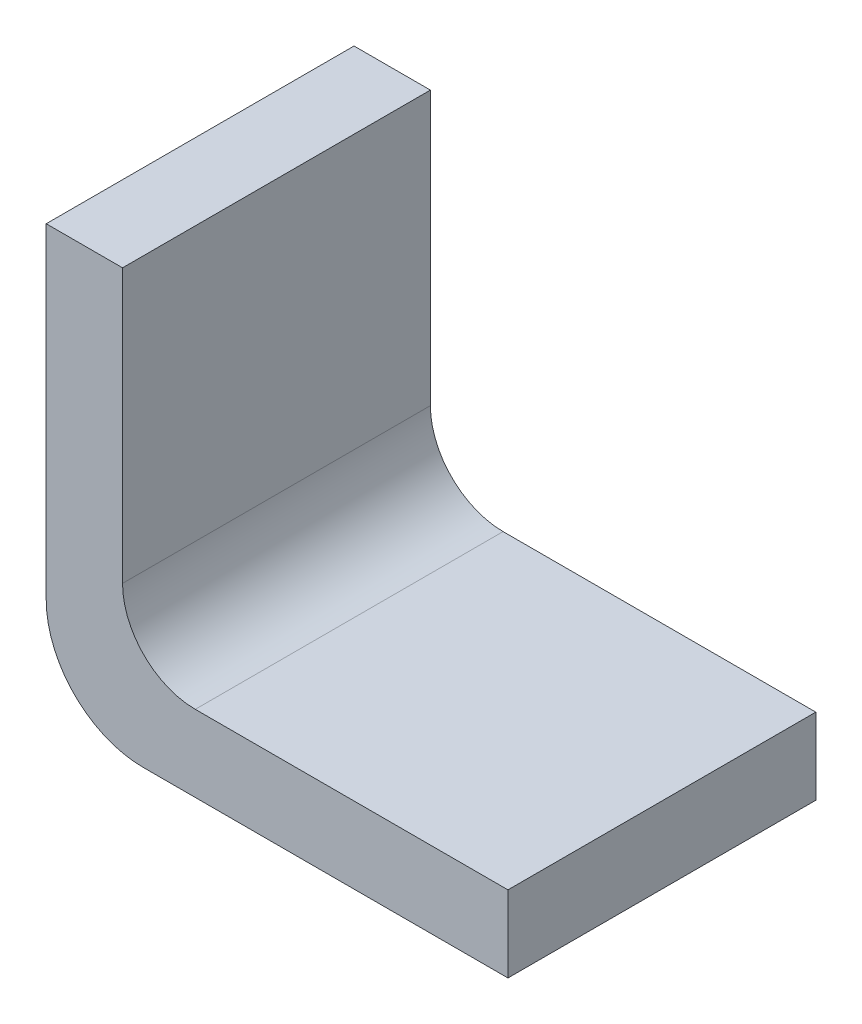
ISO-10303-21;
HEADER;
FILE_DESCRIPTION(('STEP AP214'),'2;1');
FILE_NAME('part.step','',(''),(''),'','','');
FILE_SCHEMA(('AUTOMOTIVE_DESIGN { 1 0 10303 214 1 1 1 1 }'));
ENDSEC;
DATA;
#1=APPLICATION_CONTEXT('core data for automotive mechanical design processes');
#2=APPLICATION_PROTOCOL_DEFINITION('international standard','automotive_design',2000,#1);
#3=PRODUCT_CONTEXT('',#1,'mechanical');
#4=PRODUCT('Part','Part','',(#3));
#5=PRODUCT_RELATED_PRODUCT_CATEGORY('part','',(#4));
#6=PRODUCT_DEFINITION_FORMATION('','',#4);
#7=PRODUCT_DEFINITION_CONTEXT('part definition',#1,'design');
#8=PRODUCT_DEFINITION('design','',#6,#7);
#9=PRODUCT_DEFINITION_SHAPE('','',#8);
#10=(LENGTH_UNIT() NAMED_UNIT(*) SI_UNIT(.MILLI.,.METRE.));
#11=(NAMED_UNIT(*) PLANE_ANGLE_UNIT() SI_UNIT($,.RADIAN.));
#12=(NAMED_UNIT(*) SI_UNIT($,.STERADIAN.) SOLID_ANGLE_UNIT());
#13=UNCERTAINTY_MEASURE_WITH_UNIT(LENGTH_MEASURE(1.E-05),#10,'distance_accuracy_value','');
#14=(GEOMETRIC_REPRESENTATION_CONTEXT(3) GLOBAL_UNCERTAINTY_ASSIGNED_CONTEXT((#13)) GLOBAL_UNIT_ASSIGNED_CONTEXT((#10,
#11,#12)) REPRESENTATION_CONTEXT('',''));
#15=CARTESIAN_POINT('',(0.,0.,0.));
#16=DIRECTION('',(0.,0.,1.));
#17=DIRECTION('',(1.,0.,0.));
#18=AXIS2_PLACEMENT_3D('',#15,#16,#17);
#19=CARTESIAN_POINT('',(2.,2.,6.35));
#20=DIRECTION('',(0.,0.,-1.));
#21=DIRECTION('',(-1.,0.,0.));
#22=AXIS2_PLACEMENT_3D('',#19,#20,#21);
#23=CYLINDRICAL_SURFACE('',#22,2.);
#24=CARTESIAN_POINT('',(2.,2.,0.));
#25=DIRECTION('',(0.,0.,1.));
#26=DIRECTION('',(1.,0.,0.));
#27=AXIS2_PLACEMENT_3D('',#24,#25,#26);
#28=CIRCLE('',#27,2.);
#29=CARTESIAN_POINT('',(0.,2.00000000000001,0.));
#30=VERTEX_POINT('',#29);
#31=CARTESIAN_POINT('',(2.00000000000001,0.,0.));
#32=VERTEX_POINT('',#31);
#33=EDGE_CURVE('E129',#30,#32,#28,.T.);
#34=ORIENTED_EDGE('',*,*,#33,.T.);
#35=DIRECTION('',(0.,0.,-1.));
#36=VECTOR('',#35,1.);
#37=CARTESIAN_POINT('',(2.00000000000001,0.,6.35));
#38=LINE('',#37,#36);
#39=CARTESIAN_POINT('',(2.00000000000001,0.,6.35));
#40=VERTEX_POINT('',#39);
#41=EDGE_CURVE('E11',#40,#32,#38,.T.);
#42=ORIENTED_EDGE('',*,*,#41,.F.);
#43=CARTESIAN_POINT('',(2.,2.,6.35));
#44=DIRECTION('',(0.,0.,1.));
#45=DIRECTION('',(1.,0.,0.));
#46=AXIS2_PLACEMENT_3D('',#43,#44,#45);
#47=CIRCLE('',#46,2.);
#48=CARTESIAN_POINT('',(0.,2.00000000000001,6.35));
#49=VERTEX_POINT('',#48);
#50=EDGE_CURVE('E143',#49,#40,#47,.T.);
#51=ORIENTED_EDGE('',*,*,#50,.F.);
#52=DIRECTION('',(0.,0.,-1.));
#53=VECTOR('',#52,1.);
#54=CARTESIAN_POINT('',(0.,2.00000000000001,6.35));
#55=LINE('',#54,#53);
#56=EDGE_CURVE('E125',#49,#30,#55,.T.);
#57=ORIENTED_EDGE('',*,*,#56,.T.);
#58=EDGE_LOOP('',(#34,#42,#51,#57));
#59=FACE_BOUND('',#58,.T.);
#60=ADVANCED_FACE('F33',(#59),#23,.T.);
#61=CARTESIAN_POINT('',(9.525,0.,6.35));
#62=DIRECTION('',(0.,1.,0.));
#63=DIRECTION('',(-1.,0.,0.));
#64=AXIS2_PLACEMENT_3D('',#61,#62,#63);
#65=PLANE('',#64);
#66=DIRECTION('',(1.,0.,0.));
#67=VECTOR('',#66,1.);
#68=CARTESIAN_POINT('',(9.525,0.,0.));
#69=LINE('',#68,#67);
#70=CARTESIAN_POINT('',(9.525,0.,0.));
#71=VERTEX_POINT('',#70);
#72=EDGE_CURVE('E132',#32,#71,#69,.T.);
#73=ORIENTED_EDGE('',*,*,#72,.T.);
#74=DIRECTION('',(0.,0.,-1.));
#75=VECTOR('',#74,1.);
#76=CARTESIAN_POINT('',(9.525,0.,6.35));
#77=LINE('',#76,#75);
#78=CARTESIAN_POINT('',(9.525,0.,6.35));
#79=VERTEX_POINT('',#78);
#80=EDGE_CURVE('E41',#79,#71,#77,.T.);
#81=ORIENTED_EDGE('',*,*,#80,.F.);
#82=DIRECTION('',(1.,0.,0.));
#83=VECTOR('',#82,1.);
#84=CARTESIAN_POINT('',(9.525,0.,6.35));
#85=LINE('',#84,#83);
#86=EDGE_CURVE('E92',#40,#79,#85,.T.);
#87=ORIENTED_EDGE('',*,*,#86,.F.);
#88=ORIENTED_EDGE('',*,*,#41,.T.);
#89=EDGE_LOOP('',(#73,#81,#87,#88));
#90=FACE_BOUND('',#89,.T.);
#91=ADVANCED_FACE('F178',(#90),#65,.F.);
#92=CARTESIAN_POINT('',(9.525,1.5748,6.35));
#93=DIRECTION('',(-1.,0.,0.));
#94=DIRECTION('',(0.,0.,1.));
#95=AXIS2_PLACEMENT_3D('',#92,#93,#94);
#96=PLANE('',#95);
#97=DIRECTION('',(0.,1.,0.));
#98=VECTOR('',#97,1.);
#99=CARTESIAN_POINT('',(9.525,1.5748,0.));
#100=LINE('',#99,#98);
#101=CARTESIAN_POINT('',(9.525,1.5748,0.));
#102=VERTEX_POINT('',#101);
#103=EDGE_CURVE('E134',#71,#102,#100,.T.);
#104=ORIENTED_EDGE('',*,*,#103,.T.);
#105=DIRECTION('',(0.,0.,-1.));
#106=VECTOR('',#105,1.);
#107=CARTESIAN_POINT('',(9.525,1.5748,6.35));
#108=LINE('',#107,#106);
#109=CARTESIAN_POINT('',(9.525,1.5748,6.35));
#110=VERTEX_POINT('',#109);
#111=EDGE_CURVE('E150',#110,#102,#108,.T.);
#112=ORIENTED_EDGE('',*,*,#111,.F.);
#113=DIRECTION('',(0.,1.,0.));
#114=VECTOR('',#113,1.);
#115=CARTESIAN_POINT('',(9.525,1.5748,6.35));
#116=LINE('',#115,#114);
#117=EDGE_CURVE('E158',#79,#110,#116,.T.);
#118=ORIENTED_EDGE('',*,*,#117,.F.);
#119=ORIENTED_EDGE('',*,*,#80,.T.);
#120=EDGE_LOOP('',(#104,#112,#118,#119));
#121=FACE_BOUND('',#120,.T.);
#122=ADVANCED_FACE('F156',(#121),#96,.F.);
#123=CARTESIAN_POINT('',(3.0748,1.5748,6.35));
#124=DIRECTION('',(0.,-1.,0.));
#125=DIRECTION('',(1.,0.,0.));
#126=AXIS2_PLACEMENT_3D('',#123,#124,#125);
#127=PLANE('',#126);
#128=DIRECTION('',(-1.,0.,0.));
#129=VECTOR('',#128,1.);
#130=CARTESIAN_POINT('',(3.0748,1.5748,0.));
#131=LINE('',#130,#129);
#132=CARTESIAN_POINT('',(3.0748,1.5748,0.));
#133=VERTEX_POINT('',#132);
#134=EDGE_CURVE('E136',#102,#133,#131,.T.);
#135=ORIENTED_EDGE('',*,*,#134,.T.);
#136=DIRECTION('',(0.,0.,-1.));
#137=VECTOR('',#136,1.);
#138=CARTESIAN_POINT('',(3.0748,1.5748,6.35));
#139=LINE('',#138,#137);
#140=CARTESIAN_POINT('',(3.0748,1.5748,6.35));
#141=VERTEX_POINT('',#140);
#142=EDGE_CURVE('E147',#141,#133,#139,.T.);
#143=ORIENTED_EDGE('',*,*,#142,.F.);
#144=DIRECTION('',(-1.,0.,0.));
#145=VECTOR('',#144,1.);
#146=CARTESIAN_POINT('',(3.0748,1.5748,6.35));
#147=LINE('',#146,#145);
#148=EDGE_CURVE('E170',#110,#141,#147,.T.);
#149=ORIENTED_EDGE('',*,*,#148,.F.);
#150=ORIENTED_EDGE('',*,*,#111,.T.);
#151=EDGE_LOOP('',(#135,#143,#149,#150));
#152=FACE_BOUND('',#151,.T.);
#153=ADVANCED_FACE('F166',(#152),#127,.F.);
#154=CARTESIAN_POINT('',(3.0748,3.0748,6.35));
#155=DIRECTION('',(0.,0.,-1.));
#156=DIRECTION('',(-1.,0.,0.));
#157=AXIS2_PLACEMENT_3D('',#154,#155,#156);
#158=CYLINDRICAL_SURFACE('',#157,1.5);
#159=CARTESIAN_POINT('',(3.0748,3.0748,0.));
#160=DIRECTION('',(0.,0.,-1.));
#161=DIRECTION('',(-1.,0.,0.));
#162=AXIS2_PLACEMENT_3D('',#159,#160,#161);
#163=CIRCLE('',#162,1.5);
#164=CARTESIAN_POINT('',(1.5748,3.0748,0.));
#165=VERTEX_POINT('',#164);
#166=EDGE_CURVE('E138',#133,#165,#163,.T.);
#167=ORIENTED_EDGE('',*,*,#166,.T.);
#168=DIRECTION('',(0.,0.,-1.));
#169=VECTOR('',#168,1.);
#170=CARTESIAN_POINT('',(1.5748,3.0748,6.35));
#171=LINE('',#170,#169);
#172=CARTESIAN_POINT('',(1.5748,3.0748,6.35));
#173=VERTEX_POINT('',#172);
#174=EDGE_CURVE('E120',#173,#165,#171,.T.);
#175=ORIENTED_EDGE('',*,*,#174,.F.);
#176=CARTESIAN_POINT('',(3.0748,3.0748,6.35));
#177=DIRECTION('',(0.,0.,-1.));
#178=DIRECTION('',(-1.,0.,0.));
#179=AXIS2_PLACEMENT_3D('',#176,#177,#178);
#180=CIRCLE('',#179,1.5);
#181=EDGE_CURVE('E111',#141,#173,#180,.T.);
#182=ORIENTED_EDGE('',*,*,#181,.F.);
#183=ORIENTED_EDGE('',*,*,#142,.T.);
#184=EDGE_LOOP('',(#167,#175,#182,#183));
#185=FACE_BOUND('',#184,.T.);
#186=ADVANCED_FACE('F169',(#185),#158,.F.);
#187=CARTESIAN_POINT('',(1.5748,8.7122,6.35));
#188=DIRECTION('',(-1.,0.,0.));
#189=DIRECTION('',(0.,-1.,0.));
#190=AXIS2_PLACEMENT_3D('',#187,#188,#189);
#191=PLANE('',#190);
#192=DIRECTION('',(0.,1.,0.));
#193=VECTOR('',#192,1.);
#194=CARTESIAN_POINT('',(1.5748,8.7122,0.));
#195=LINE('',#194,#193);
#196=CARTESIAN_POINT('',(1.5748,8.7122,0.));
#197=VERTEX_POINT('',#196);
#198=EDGE_CURVE('E119',#165,#197,#195,.T.);
#199=ORIENTED_EDGE('',*,*,#198,.T.);
#200=DIRECTION('',(0.,0.,-1.));
#201=VECTOR('',#200,1.);
#202=CARTESIAN_POINT('',(1.5748,8.7122,6.35));
#203=LINE('',#202,#201);
#204=CARTESIAN_POINT('',(1.5748,8.7122,6.35));
#205=VERTEX_POINT('',#204);
#206=EDGE_CURVE('E116',#205,#197,#203,.T.);
#207=ORIENTED_EDGE('',*,*,#206,.F.);
#208=DIRECTION('',(0.,1.,0.));
#209=VECTOR('',#208,1.);
#210=CARTESIAN_POINT('',(1.5748,8.7122,6.35));
#211=LINE('',#210,#209);
#212=EDGE_CURVE('E105',#173,#205,#211,.T.);
#213=ORIENTED_EDGE('',*,*,#212,.F.);
#214=ORIENTED_EDGE('',*,*,#174,.T.);
#215=EDGE_LOOP('',(#199,#207,#213,#214));
#216=FACE_BOUND('',#215,.T.);
#217=ADVANCED_FACE('F117',(#216),#191,.F.);
#218=CARTESIAN_POINT('',(0.,8.7122,6.35));
#219=DIRECTION('',(0.,-1.,0.));
#220=DIRECTION('',(0.,0.,-1.));
#221=AXIS2_PLACEMENT_3D('',#218,#219,#220);
#222=PLANE('',#221);
#223=DIRECTION('',(-1.,0.,0.));
#224=VECTOR('',#223,1.);
#225=CARTESIAN_POINT('',(0.,8.7122,0.));
#226=LINE('',#225,#224);
#227=CARTESIAN_POINT('',(0.,8.7122,0.));
#228=VERTEX_POINT('',#227);
#229=EDGE_CURVE('E78',#197,#228,#226,.T.);
#230=ORIENTED_EDGE('',*,*,#229,.T.);
#231=DIRECTION('',(0.,0.,-1.));
#232=VECTOR('',#231,1.);
#233=CARTESIAN_POINT('',(0.,8.7122,6.35));
#234=LINE('',#233,#232);
#235=CARTESIAN_POINT('',(0.,8.7122,6.35));
#236=VERTEX_POINT('',#235);
#237=EDGE_CURVE('E121',#236,#228,#234,.T.);
#238=ORIENTED_EDGE('',*,*,#237,.F.);
#239=DIRECTION('',(-1.,0.,0.));
#240=VECTOR('',#239,1.);
#241=CARTESIAN_POINT('',(0.,8.7122,6.35));
#242=LINE('',#241,#240);
#243=EDGE_CURVE('E109',#205,#236,#242,.T.);
#244=ORIENTED_EDGE('',*,*,#243,.F.);
#245=ORIENTED_EDGE('',*,*,#206,.T.);
#246=EDGE_LOOP('',(#230,#238,#244,#245));
#247=FACE_BOUND('',#246,.T.);
#248=ADVANCED_FACE('F123',(#247),#222,.F.);
#249=CARTESIAN_POINT('',(0.,2.00000000000001,6.35));
#250=DIRECTION('',(1.,0.,0.));
#251=DIRECTION('',(0.,0.,-1.));
#252=AXIS2_PLACEMENT_3D('',#249,#250,#251);
#253=PLANE('',#252);
#254=DIRECTION('',(0.,-1.,0.));
#255=VECTOR('',#254,1.);
#256=CARTESIAN_POINT('',(0.,2.00000000000001,0.));
#257=LINE('',#256,#255);
#258=EDGE_CURVE('E84',#228,#30,#257,.T.);
#259=ORIENTED_EDGE('',*,*,#258,.T.);
#260=ORIENTED_EDGE('',*,*,#56,.F.);
#261=DIRECTION('',(0.,-1.,0.));
#262=VECTOR('',#261,1.);
#263=CARTESIAN_POINT('',(0.,2.00000000000001,6.35));
#264=LINE('',#263,#262);
#265=EDGE_CURVE('E49',#236,#49,#264,.T.);
#266=ORIENTED_EDGE('',*,*,#265,.F.);
#267=ORIENTED_EDGE('',*,*,#237,.T.);
#268=EDGE_LOOP('',(#259,#260,#266,#267));
#269=FACE_BOUND('',#268,.T.);
#270=ADVANCED_FACE('F194',(#269),#253,.F.);
#271=CARTESIAN_POINT('',(2.,2.,6.35));
#272=DIRECTION('',(0.,0.,1.));
#273=DIRECTION('',(1.,0.,0.));
#274=AXIS2_PLACEMENT_3D('',#271,#272,#273);
#275=PLANE('',#274);
#276=ORIENTED_EDGE('',*,*,#50,.T.);
#277=ORIENTED_EDGE('',*,*,#86,.T.);
#278=ORIENTED_EDGE('',*,*,#117,.T.);
#279=ORIENTED_EDGE('',*,*,#148,.T.);
#280=ORIENTED_EDGE('',*,*,#181,.T.);
#281=ORIENTED_EDGE('',*,*,#212,.T.);
#282=ORIENTED_EDGE('',*,*,#243,.T.);
#283=ORIENTED_EDGE('',*,*,#265,.T.);
#284=EDGE_LOOP('',(#276,#277,#278,#279,#280,#281,#282,#283));
#285=FACE_BOUND('',#284,.T.);
#286=ADVANCED_FACE('F107',(#285),#275,.T.);
#287=CARTESIAN_POINT('',(2.,2.,0.));
#288=DIRECTION('',(0.,0.,1.));
#289=DIRECTION('',(1.,0.,0.));
#290=AXIS2_PLACEMENT_3D('',#287,#288,#289);
#291=PLANE('',#290);
#292=ORIENTED_EDGE('',*,*,#33,.F.);
#293=ORIENTED_EDGE('',*,*,#258,.F.);
#294=ORIENTED_EDGE('',*,*,#229,.F.);
#295=ORIENTED_EDGE('',*,*,#198,.F.);
#296=ORIENTED_EDGE('',*,*,#166,.F.);
#297=ORIENTED_EDGE('',*,*,#134,.F.);
#298=ORIENTED_EDGE('',*,*,#103,.F.);
#299=ORIENTED_EDGE('',*,*,#72,.F.);
#300=EDGE_LOOP('',(#292,#293,#294,#295,#296,#297,#298,#299));
#301=FACE_BOUND('',#300,.T.);
#302=ADVANCED_FACE('F162',(#301),#291,.F.);
#303=CLOSED_SHELL('',(#60,#91,#122,#153,#186,#217,#248,#270,#286,#302));
#304=MANIFOLD_SOLID_BREP('B2',#303);
#305=ADVANCED_BREP_SHAPE_REPRESENTATION('',(#18,#304),#14);
#306=SHAPE_DEFINITION_REPRESENTATION(#9,#305);
ENDSEC;
END-ISO-10303-21;
